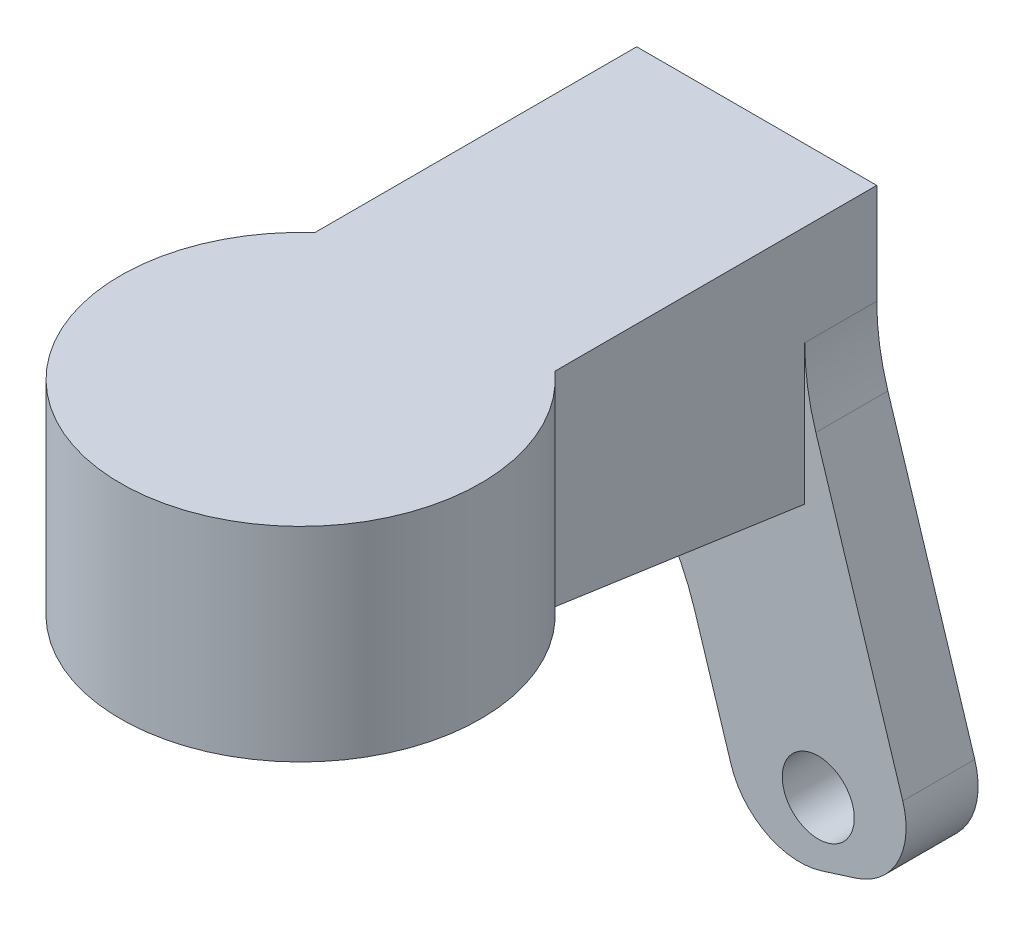
ISO-10303-21;
HEADER;
FILE_DESCRIPTION(('STEP AP214'),'2;1');
FILE_NAME('part.step','',(''),(''),'','','');
FILE_SCHEMA(('AUTOMOTIVE_DESIGN { 1 0 10303 214 1 1 1 1 }'));
ENDSEC;
DATA;
#1=APPLICATION_CONTEXT('core data for automotive mechanical design processes');
#2=APPLICATION_PROTOCOL_DEFINITION('international standard','automotive_design',2000,#1);
#3=PRODUCT_CONTEXT('',#1,'mechanical');
#4=PRODUCT('Part','Part','',(#3));
#5=PRODUCT_RELATED_PRODUCT_CATEGORY('part','',(#4));
#6=PRODUCT_DEFINITION_FORMATION('','',#4);
#7=PRODUCT_DEFINITION_CONTEXT('part definition',#1,'design');
#8=PRODUCT_DEFINITION('design','',#6,#7);
#9=PRODUCT_DEFINITION_SHAPE('','',#8);
#10=(LENGTH_UNIT() NAMED_UNIT(*) SI_UNIT(.MILLI.,.METRE.));
#11=(NAMED_UNIT(*) PLANE_ANGLE_UNIT() SI_UNIT($,.RADIAN.));
#12=(NAMED_UNIT(*) SI_UNIT($,.STERADIAN.) SOLID_ANGLE_UNIT());
#13=UNCERTAINTY_MEASURE_WITH_UNIT(LENGTH_MEASURE(1.E-05),#10,'distance_accuracy_value','');
#14=(GEOMETRIC_REPRESENTATION_CONTEXT(3) GLOBAL_UNCERTAINTY_ASSIGNED_CONTEXT((#13)) GLOBAL_UNIT_ASSIGNED_CONTEXT((#10,
#11,#12)) REPRESENTATION_CONTEXT('',''));
#15=CARTESIAN_POINT('',(0.,0.,0.));
#16=DIRECTION('',(0.,0.,1.));
#17=DIRECTION('',(1.,0.,0.));
#18=AXIS2_PLACEMENT_3D('',#15,#16,#17);
#19=CARTESIAN_POINT('',(0.,8.5,0.));
#20=DIRECTION('',(0.,-1.,0.));
#21=DIRECTION('',(0.,0.,-1.));
#22=AXIS2_PLACEMENT_3D('',#19,#20,#21);
#23=CYLINDRICAL_SURFACE('',#22,7.5);
#24=CARTESIAN_POINT('',(0.,8.5,0.));
#25=DIRECTION('',(0.,1.,0.));
#26=DIRECTION('',(0.,0.,1.));
#27=AXIS2_PLACEMENT_3D('',#24,#25,#26);
#28=CIRCLE('',#27,7.5);
#29=CARTESIAN_POINT('',(-5.,8.5,-5.59016994374948));
#30=VERTEX_POINT('',#29);
#31=CARTESIAN_POINT('',(5.,8.5,-5.59016994374947));
#32=VERTEX_POINT('',#31);
#33=EDGE_CURVE('E201',#30,#32,#28,.T.);
#34=ORIENTED_EDGE('',*,*,#33,.F.);
#35=DIRECTION('',(0.,1.,0.));
#36=VECTOR('',#35,1.);
#37=CARTESIAN_POINT('',(-5.,0.,-5.59016994374948));
#38=LINE('',#37,#36);
#39=CARTESIAN_POINT('',(-5.,0.,-5.59016994374948));
#40=VERTEX_POINT('',#39);
#41=EDGE_CURVE('E187',#40,#30,#38,.T.);
#42=ORIENTED_EDGE('',*,*,#41,.F.);
#43=CARTESIAN_POINT('',(0.,0.,0.));
#44=DIRECTION('',(0.,1.,0.));
#45=DIRECTION('',(0.,0.,1.));
#46=AXIS2_PLACEMENT_3D('',#43,#44,#45);
#47=CIRCLE('',#46,7.5);
#48=CARTESIAN_POINT('',(5.,0.,-5.59016994374947));
#49=VERTEX_POINT('',#48);
#50=EDGE_CURVE('E198',#40,#49,#47,.T.);
#51=ORIENTED_EDGE('',*,*,#50,.T.);
#52=DIRECTION('',(0.,1.,0.));
#53=VECTOR('',#52,1.);
#54=CARTESIAN_POINT('',(5.,0.,-5.59016994374948));
#55=LINE('',#54,#53);
#56=EDGE_CURVE('E192',#49,#32,#55,.T.);
#57=ORIENTED_EDGE('',*,*,#56,.T.);
#58=EDGE_LOOP('',(#34,#42,#51,#57));
#59=FACE_BOUND('',#58,.T.);
#60=ADVANCED_FACE('F33',(#59),#23,.T.);
#61=CARTESIAN_POINT('',(0.,8.5,0.));
#62=DIRECTION('',(0.,1.,0.));
#63=DIRECTION('',(0.,0.,1.));
#64=AXIS2_PLACEMENT_3D('',#61,#62,#63);
#65=PLANE('',#64);
#66=ORIENTED_EDGE('',*,*,#33,.T.);
#67=DIRECTION('',(0.,0.,-1.));
#68=VECTOR('',#67,1.);
#69=CARTESIAN_POINT('',(5.,8.5,-19.));
#70=LINE('',#69,#68);
#71=CARTESIAN_POINT('',(5.,8.5,-19.));
#72=VERTEX_POINT('',#71);
#73=EDGE_CURVE('E181',#32,#72,#70,.T.);
#74=ORIENTED_EDGE('',*,*,#73,.T.);
#75=DIRECTION('',(-1.,0.,0.));
#76=VECTOR('',#75,1.);
#77=CARTESIAN_POINT('',(5.,8.5,-19.));
#78=LINE('',#77,#76);
#79=CARTESIAN_POINT('',(-5.,8.5,-19.));
#80=VERTEX_POINT('',#79);
#81=EDGE_CURVE('E184',#72,#80,#78,.T.);
#82=ORIENTED_EDGE('',*,*,#81,.T.);
#83=DIRECTION('',(0.,0.,1.));
#84=VECTOR('',#83,1.);
#85=CARTESIAN_POINT('',(-5.,8.5,-19.));
#86=LINE('',#85,#84);
#87=EDGE_CURVE('E172',#80,#30,#86,.T.);
#88=ORIENTED_EDGE('',*,*,#87,.T.);
#89=EDGE_LOOP('',(#66,#74,#82,#88));
#90=FACE_BOUND('',#89,.T.);
#91=ADVANCED_FACE('F270',(#90),#65,.T.);
#92=CARTESIAN_POINT('',(0.,0.,0.));
#93=DIRECTION('',(0.,1.,0.));
#94=DIRECTION('',(0.,0.,1.));
#95=AXIS2_PLACEMENT_3D('',#92,#93,#94);
#96=PLANE('',#95);
#97=ORIENTED_EDGE('',*,*,#50,.F.);
#98=DIRECTION('',(1.,0.,0.));
#99=VECTOR('',#98,1.);
#100=CARTESIAN_POINT('',(-5.,0.,-5.59016994374947));
#101=LINE('',#100,#99);
#102=CARTESIAN_POINT('',(-1.34629120178363,0.,-5.59016994374947));
#103=VERTEX_POINT('',#102);
#104=EDGE_CURVE('E151',#40,#103,#101,.T.);
#105=ORIENTED_EDGE('',*,*,#104,.T.);
#106=CARTESIAN_POINT('',(0.,0.,0.));
#107=DIRECTION('',(0.,-1.,0.));
#108=DIRECTION('',(0.,0.,-1.));
#109=AXIS2_PLACEMENT_3D('',#106,#107,#108);
#110=CIRCLE('',#109,5.75);
#111=CARTESIAN_POINT('',(1.34629120178362,0.,-5.59016994374947));
#112=VERTEX_POINT('',#111);
#113=EDGE_CURVE('E189',#112,#103,#110,.T.);
#114=ORIENTED_EDGE('',*,*,#113,.F.);
#115=EDGE_CURVE('E146',#112,#49,#101,.T.);
#116=ORIENTED_EDGE('',*,*,#115,.T.);
#117=EDGE_LOOP('',(#97,#105,#114,#116));
#118=FACE_BOUND('',#117,.T.);
#119=ADVANCED_FACE('F282',(#118),#96,.F.);
#120=CARTESIAN_POINT('',(0.,4.5,0.));
#121=DIRECTION('',(0.,-1.,0.));
#122=DIRECTION('',(0.,0.,-1.));
#123=AXIS2_PLACEMENT_3D('',#120,#121,#122);
#124=CYLINDRICAL_SURFACE('',#123,5.75);
#125=CARTESIAN_POINT('',(0.,4.5,0.));
#126=DIRECTION('',(0.,-1.,0.));
#127=DIRECTION('',(0.,0.,-1.));
#128=AXIS2_PLACEMENT_3D('',#125,#126,#127);
#129=CIRCLE('',#128,5.75);
#130=CARTESIAN_POINT('',(0.,4.5,-5.75));
#131=VERTEX_POINT('',#130);
#132=EDGE_CURVE('E195',#131,#131,#129,.T.);
#133=ORIENTED_EDGE('',*,*,#132,.F.);
#134=EDGE_LOOP('',(#133));
#135=FACE_BOUND('',#134,.T.);
#136=ORIENTED_EDGE('',*,*,#113,.T.);
#137=CARTESIAN_POINT('',(0.,0.,0.));
#138=DIRECTION('',(0.,1.,0.));
#139=DIRECTION('',(0.,0.,1.));
#140=AXIS2_PLACEMENT_3D('',#137,#138,#139);
#141=CIRCLE('',#140,5.75);
#142=EDGE_CURVE('E157',#103,#112,#141,.F.);
#143=ORIENTED_EDGE('',*,*,#142,.T.);
#144=EDGE_LOOP('',(#136,#143));
#145=FACE_BOUND('',#144,.T.);
#146=ADVANCED_FACE('F281',(#135,#145),#124,.F.);
#147=CARTESIAN_POINT('',(0.,4.5,0.));
#148=DIRECTION('',(0.,-1.,0.));
#149=DIRECTION('',(0.,0.,-1.));
#150=AXIS2_PLACEMENT_3D('',#147,#148,#149);
#151=PLANE('',#150);
#152=ORIENTED_EDGE('',*,*,#132,.T.);
#153=EDGE_LOOP('',(#152));
#154=FACE_BOUND('',#153,.T.);
#155=ADVANCED_FACE('F325',(#154),#151,.T.);
#156=CARTESIAN_POINT('',(-5.,0.,-19.));
#157=DIRECTION('',(-1.,0.,0.));
#158=DIRECTION('',(0.,0.,1.));
#159=AXIS2_PLACEMENT_3D('',#156,#157,#158);
#160=PLANE('',#159);
#161=ORIENTED_EDGE('',*,*,#87,.F.);
#162=DIRECTION('',(0.,1.,0.));
#163=VECTOR('',#162,1.);
#164=CARTESIAN_POINT('',(-5.,0.,-19.));
#165=LINE('',#164,#163);
#166=CARTESIAN_POINT('',(-5.,-1.5,-19.));
#167=VERTEX_POINT('',#166);
#168=EDGE_CURVE('E145',#167,#80,#165,.T.);
#169=ORIENTED_EDGE('',*,*,#168,.F.);
#170=DIRECTION('',(0.,0.,-1.));
#171=VECTOR('',#170,1.);
#172=CARTESIAN_POINT('',(-5.,-1.5,-16.));
#173=LINE('',#172,#171);
#174=CARTESIAN_POINT('',(-5.,-1.5,-16.));
#175=VERTEX_POINT('',#174);
#176=EDGE_CURVE('E137',#175,#167,#173,.T.);
#177=ORIENTED_EDGE('',*,*,#176,.F.);
#178=DIRECTION('',(0.,-0.142621535363485,-0.989777296996937));
#179=VECTOR('',#178,1.);
#180=CARTESIAN_POINT('',(-5.,-1.5,-16.));
#181=LINE('',#180,#179);
#182=EDGE_CURVE('E144',#40,#175,#181,.T.);
#183=ORIENTED_EDGE('',*,*,#182,.F.);
#184=ORIENTED_EDGE('',*,*,#41,.T.);
#185=EDGE_LOOP('',(#161,#169,#177,#183,#184));
#186=FACE_BOUND('',#185,.T.);
#187=ADVANCED_FACE('F142',(#186),#160,.T.);
#188=CARTESIAN_POINT('',(5.,0.,-19.));
#189=DIRECTION('',(0.,0.,-1.));
#190=DIRECTION('',(-1.,0.,0.));
#191=AXIS2_PLACEMENT_3D('',#188,#189,#190);
#192=PLANE('',#191);
#193=DIRECTION('',(-0.300705799504267,0.953716950748229,0.));
#194=VECTOR('',#193,1.);
#195=CARTESIAN_POINT('',(-3.527567189288,4.88776233752828,-19.));
#196=LINE('',#195,#194);
#197=CARTESIAN_POINT('',(1.93024307171444,-12.4222003185521,-19.));
#198=VERTEX_POINT('',#197);
#199=CARTESIAN_POINT('',(0.410342102204099,-7.60169030354616,-19.));
#200=VERTEX_POINT('',#199);
#201=EDGE_CURVE('E167',#198,#200,#196,.T.);
#202=ORIENTED_EDGE('',*,*,#201,.T.);
#203=CARTESIAN_POINT('',(-9.12682740527819,-10.6087482985888,-19.));
#204=DIRECTION('',(0.,0.,-1.));
#205=DIRECTION('',(-1.,0.,0.));
#206=AXIS2_PLACEMENT_3D('',#203,#204,#205);
#207=CIRCLE('',#206,10.);
#208=EDGE_CURVE('E11',#200,#167,#207,.F.);
#209=ORIENTED_EDGE('',*,*,#208,.T.);
#210=ORIENTED_EDGE('',*,*,#168,.T.);
#211=ORIENTED_EDGE('',*,*,#81,.F.);
#212=DIRECTION('',(0.,1.,0.));
#213=VECTOR('',#212,1.);
#214=CARTESIAN_POINT('',(5.,0.,-19.));
#215=LINE('',#214,#213);
#216=CARTESIAN_POINT('',(5.,4.32224319945035,-19.));
#217=VERTEX_POINT('',#216);
#218=EDGE_CURVE('E190',#217,#72,#215,.T.);
#219=ORIENTED_EDGE('',*,*,#218,.F.);
#220=CARTESIAN_POINT('',(15.,4.32224319945035,-19.));
#221=DIRECTION('',(0.,0.,-1.));
#222=DIRECTION('',(-1.,0.,0.));
#223=AXIS2_PLACEMENT_3D('',#220,#221,#222);
#224=CIRCLE('',#223,10.);
#225=CARTESIAN_POINT('',(5.46283049251771,1.31518520440768,-19.));
#226=VERTEX_POINT('',#225);
#227=EDGE_CURVE('E233',#217,#226,#224,.F.);
#228=ORIENTED_EDGE('',*,*,#227,.T.);
#229=DIRECTION('',(0.300705799504267,-0.953716950748229,0.));
#230=VECTOR('',#229,1.);
#231=CARTESIAN_POINT('',(3.62530994132371,7.14305583381028,-19.));
#232=LINE('',#231,#230);
#233=CARTESIAN_POINT('',(9.08312020232616,-10.1669068222701,-19.));
#234=VERTEX_POINT('',#233);
#235=EDGE_CURVE('E173',#226,#234,#232,.T.);
#236=ORIENTED_EDGE('',*,*,#235,.T.);
#237=CARTESIAN_POINT('',(6.22196935008147,-11.0690242207829,-19.));
#238=DIRECTION('',(0.,0.,-1.));
#239=DIRECTION('',(-1.,0.,0.));
#240=AXIS2_PLACEMENT_3D('',#237,#238,#239);
#241=CIRCLE('',#240,3.);
#242=CARTESIAN_POINT('',(7.12408674859427,-13.9301750730276,-19.));
#243=VERTEX_POINT('',#242);
#244=EDGE_CURVE('E214',#234,#243,#241,.T.);
#245=ORIENTED_EDGE('',*,*,#244,.T.);
#246=DIRECTION('',(-0.953716950748229,-0.300705799504267,0.));
#247=VECTOR('',#246,1.);
#248=CARTESIAN_POINT('',(9.98523760083896,-13.0280576745148,-19.));
#249=LINE('',#248,#247);
#250=CARTESIAN_POINT('',(5.69351132247193,-14.381233772284,-19.));
#251=VERTEX_POINT('',#250);
#252=EDGE_CURVE('E175',#243,#251,#249,.T.);
#253=ORIENTED_EDGE('',*,*,#252,.T.);
#254=CARTESIAN_POINT('',(4.79139392395913,-11.5200829200393,-19.));
#255=DIRECTION('',(0.,0.,-1.));
#256=DIRECTION('',(-1.,0.,0.));
#257=AXIS2_PLACEMENT_3D('',#254,#255,#256);
#258=CIRCLE('',#257,3.);
#259=EDGE_CURVE('E216',#251,#198,#258,.T.);
#260=ORIENTED_EDGE('',*,*,#259,.T.);
#261=EDGE_LOOP('',(#202,#209,#210,#211,#219,#228,#236,#245,#253,#260));
#262=FACE_BOUND('',#261,.T.);
#263=CARTESIAN_POINT('',(5.56323634885337,-11.8009865008351,-19.));
#264=DIRECTION('',(0.,0.,-1.));
#265=DIRECTION('',(-1.,0.,0.));
#266=AXIS2_PLACEMENT_3D('',#263,#264,#265);
#267=CIRCLE('',#266,1.5);
#268=CARTESIAN_POINT('',(4.06323634885337,-11.8009865008351,-19.));
#269=VERTEX_POINT('',#268);
#270=EDGE_CURVE('E160',#269,#269,#267,.T.);
#271=ORIENTED_EDGE('',*,*,#270,.F.);
#272=EDGE_LOOP('',(#271));
#273=FACE_BOUND('',#272,.T.);
#274=ADVANCED_FACE('F239',(#262,#273),#192,.T.);
#275=CARTESIAN_POINT('',(5.,0.,-19.));
#276=DIRECTION('',(1.,0.,0.));
#277=DIRECTION('',(0.,0.,-1.));
#278=AXIS2_PLACEMENT_3D('',#275,#276,#277);
#279=PLANE('',#278);
#280=DIRECTION('',(0.,1.,0.));
#281=VECTOR('',#280,1.);
#282=CARTESIAN_POINT('',(5.,0.,-16.));
#283=LINE('',#282,#281);
#284=CARTESIAN_POINT('',(5.,-1.5,-16.));
#285=VERTEX_POINT('',#284);
#286=CARTESIAN_POINT('',(5.,4.32224319945035,-16.));
#287=VERTEX_POINT('',#286);
#288=EDGE_CURVE('E125',#285,#287,#283,.T.);
#289=ORIENTED_EDGE('',*,*,#288,.T.);
#290=DIRECTION('',(0.,0.,1.));
#291=VECTOR('',#290,1.);
#292=CARTESIAN_POINT('',(5.,4.32224319945035,-19.));
#293=LINE('',#292,#291);
#294=EDGE_CURVE('E229',#287,#217,#293,.F.);
#295=ORIENTED_EDGE('',*,*,#294,.T.);
#296=ORIENTED_EDGE('',*,*,#218,.T.);
#297=ORIENTED_EDGE('',*,*,#73,.F.);
#298=ORIENTED_EDGE('',*,*,#56,.F.);
#299=DIRECTION('',(0.,-0.142621535363485,-0.989777296996937));
#300=VECTOR('',#299,1.);
#301=CARTESIAN_POINT('',(5.,-1.5,-16.));
#302=LINE('',#301,#300);
#303=EDGE_CURVE('E152',#49,#285,#302,.T.);
#304=ORIENTED_EDGE('',*,*,#303,.T.);
#305=EDGE_LOOP('',(#289,#295,#296,#297,#298,#304));
#306=FACE_BOUND('',#305,.T.);
#307=ADVANCED_FACE('F266',(#306),#279,.T.);
#308=CARTESIAN_POINT('',(-3.527567189288,4.88776233752828,-16.));
#309=DIRECTION('',(-0.953716950748229,-0.300705799504267,0.));
#310=DIRECTION('',(0.300705799504267,-0.953716950748229,0.));
#311=AXIS2_PLACEMENT_3D('',#308,#309,#310);
#312=PLANE('',#311);
#313=DIRECTION('',(-0.300705799504267,0.953716950748229,0.));
#314=VECTOR('',#313,1.);
#315=CARTESIAN_POINT('',(-3.527567189288,4.88776233752828,-16.));
#316=LINE('',#315,#314);
#317=CARTESIAN_POINT('',(1.93024307171444,-12.4222003185521,-16.));
#318=VERTEX_POINT('',#317);
#319=CARTESIAN_POINT('',(0.410342102204099,-7.60169030354616,-16.));
#320=VERTEX_POINT('',#319);
#321=EDGE_CURVE('E170',#318,#320,#316,.T.);
#322=ORIENTED_EDGE('',*,*,#321,.T.);
#323=DIRECTION('',(0.,0.,1.));
#324=VECTOR('',#323,1.);
#325=CARTESIAN_POINT('',(0.410342102204099,-7.60169030354616,-19.));
#326=LINE('',#325,#324);
#327=EDGE_CURVE('E138',#320,#200,#326,.F.);
#328=ORIENTED_EDGE('',*,*,#327,.T.);
#329=ORIENTED_EDGE('',*,*,#201,.F.);
#330=DIRECTION('',(0.,0.,-1.));
#331=VECTOR('',#330,1.);
#332=CARTESIAN_POINT('',(1.93024307171444,-12.4222003185521,-16.));
#333=LINE('',#332,#331);
#334=EDGE_CURVE('E218',#198,#318,#333,.F.);
#335=ORIENTED_EDGE('',*,*,#334,.T.);
#336=EDGE_LOOP('',(#322,#328,#329,#335));
#337=FACE_BOUND('',#336,.T.);
#338=ADVANCED_FACE('F237',(#337),#312,.T.);
#339=CARTESIAN_POINT('',(0.,0.,-16.));
#340=DIRECTION('',(0.,0.,-1.));
#341=DIRECTION('',(-1.,0.,0.));
#342=AXIS2_PLACEMENT_3D('',#339,#340,#341);
#343=PLANE('',#342);
#344=CARTESIAN_POINT('',(5.56323634885337,-11.8009865008351,-16.));
#345=DIRECTION('',(0.,0.,-1.));
#346=DIRECTION('',(-1.,0.,0.));
#347=AXIS2_PLACEMENT_3D('',#344,#345,#346);
#348=CIRCLE('',#347,1.5);
#349=CARTESIAN_POINT('',(4.06323634885337,-11.8009865008351,-16.));
#350=VERTEX_POINT('',#349);
#351=EDGE_CURVE('E163',#350,#350,#348,.T.);
#352=ORIENTED_EDGE('',*,*,#351,.T.);
#353=EDGE_LOOP('',(#352));
#354=FACE_BOUND('',#353,.T.);
#355=ORIENTED_EDGE('',*,*,#288,.F.);
#356=DIRECTION('',(-1.,0.,0.));
#357=VECTOR('',#356,1.);
#358=CARTESIAN_POINT('',(0.,-1.5,-16.));
#359=LINE('',#358,#357);
#360=EDGE_CURVE('E122',#285,#175,#359,.T.);
#361=ORIENTED_EDGE('',*,*,#360,.T.);
#362=CARTESIAN_POINT('',(-9.12682740527819,-10.6087482985888,-16.));
#363=DIRECTION('',(0.,0.,-1.));
#364=DIRECTION('',(-1.,0.,0.));
#365=AXIS2_PLACEMENT_3D('',#362,#363,#364);
#366=CIRCLE('',#365,10.);
#367=EDGE_CURVE('E42',#175,#320,#366,.T.);
#368=ORIENTED_EDGE('',*,*,#367,.T.);
#369=ORIENTED_EDGE('',*,*,#321,.F.);
#370=CARTESIAN_POINT('',(4.79139392395913,-11.5200829200393,-16.));
#371=DIRECTION('',(0.,0.,-1.));
#372=DIRECTION('',(-1.,0.,0.));
#373=AXIS2_PLACEMENT_3D('',#370,#371,#372);
#374=CIRCLE('',#373,3.);
#375=CARTESIAN_POINT('',(5.69351132247193,-14.381233772284,-16.));
#376=VERTEX_POINT('',#375);
#377=EDGE_CURVE('E223',#318,#376,#374,.F.);
#378=ORIENTED_EDGE('',*,*,#377,.T.);
#379=DIRECTION('',(-0.953716950748229,-0.300705799504267,0.));
#380=VECTOR('',#379,1.);
#381=CARTESIAN_POINT('',(9.98523760083896,-13.0280576745148,-16.));
#382=LINE('',#381,#380);
#383=CARTESIAN_POINT('',(7.12408674859427,-13.9301750730276,-16.));
#384=VERTEX_POINT('',#383);
#385=EDGE_CURVE('E166',#384,#376,#382,.T.);
#386=ORIENTED_EDGE('',*,*,#385,.F.);
#387=CARTESIAN_POINT('',(6.22196935008147,-11.0690242207829,-16.));
#388=DIRECTION('',(0.,0.,-1.));
#389=DIRECTION('',(-1.,0.,0.));
#390=AXIS2_PLACEMENT_3D('',#387,#388,#389);
#391=CIRCLE('',#390,3.);
#392=CARTESIAN_POINT('',(9.08312020232616,-10.1669068222701,-16.));
#393=VERTEX_POINT('',#392);
#394=EDGE_CURVE('E220',#384,#393,#391,.F.);
#395=ORIENTED_EDGE('',*,*,#394,.T.);
#396=DIRECTION('',(0.300705799504267,-0.953716950748229,0.));
#397=VECTOR('',#396,1.);
#398=CARTESIAN_POINT('',(3.62530994132371,7.14305583381028,-16.));
#399=LINE('',#398,#397);
#400=CARTESIAN_POINT('',(5.46283049251771,1.31518520440768,-16.));
#401=VERTEX_POINT('',#400);
#402=EDGE_CURVE('E164',#401,#393,#399,.T.);
#403=ORIENTED_EDGE('',*,*,#402,.F.);
#404=CARTESIAN_POINT('',(15.,4.32224319945035,-16.));
#405=DIRECTION('',(0.,0.,-1.));
#406=DIRECTION('',(-1.,0.,0.));
#407=AXIS2_PLACEMENT_3D('',#404,#405,#406);
#408=CIRCLE('',#407,10.);
#409=EDGE_CURVE('E231',#401,#287,#408,.T.);
#410=ORIENTED_EDGE('',*,*,#409,.T.);
#411=EDGE_LOOP('',(#355,#361,#368,#369,#378,#386,#395,#403,#410));
#412=FACE_BOUND('',#411,.T.);
#413=ADVANCED_FACE('F123',(#354,#412),#343,.F.);
#414=CARTESIAN_POINT('',(9.98523760083896,-13.0280576745148,-16.));
#415=DIRECTION('',(0.300705799504267,-0.953716950748229,0.));
#416=DIRECTION('',(0.953716950748229,0.300705799504267,0.));
#417=AXIS2_PLACEMENT_3D('',#414,#415,#416);
#418=PLANE('',#417);
#419=ORIENTED_EDGE('',*,*,#385,.T.);
#420=DIRECTION('',(0.,0.,-1.));
#421=VECTOR('',#420,1.);
#422=CARTESIAN_POINT('',(5.69351132247193,-14.381233772284,-16.));
#423=LINE('',#422,#421);
#424=EDGE_CURVE('E211',#376,#251,#423,.T.);
#425=ORIENTED_EDGE('',*,*,#424,.T.);
#426=ORIENTED_EDGE('',*,*,#252,.F.);
#427=DIRECTION('',(0.,0.,-1.));
#428=VECTOR('',#427,1.);
#429=CARTESIAN_POINT('',(7.12408674859427,-13.9301750730276,-16.));
#430=LINE('',#429,#428);
#431=EDGE_CURVE('E207',#243,#384,#430,.F.);
#432=ORIENTED_EDGE('',*,*,#431,.T.);
#433=EDGE_LOOP('',(#419,#425,#426,#432));
#434=FACE_BOUND('',#433,.T.);
#435=ADVANCED_FACE('F247',(#434),#418,.T.);
#436=CARTESIAN_POINT('',(3.62530994132371,7.14305583381028,-16.));
#437=DIRECTION('',(0.953716950748229,0.300705799504267,0.));
#438=DIRECTION('',(-0.300705799504267,0.953716950748229,0.));
#439=AXIS2_PLACEMENT_3D('',#436,#437,#438);
#440=PLANE('',#439);
#441=ORIENTED_EDGE('',*,*,#235,.F.);
#442=DIRECTION('',(0.,0.,1.));
#443=VECTOR('',#442,1.);
#444=CARTESIAN_POINT('',(5.46283049251771,1.31518520440768,-16.));
#445=LINE('',#444,#443);
#446=EDGE_CURVE('E130',#226,#401,#445,.T.);
#447=ORIENTED_EDGE('',*,*,#446,.T.);
#448=ORIENTED_EDGE('',*,*,#402,.T.);
#449=DIRECTION('',(0.,0.,-1.));
#450=VECTOR('',#449,1.);
#451=CARTESIAN_POINT('',(9.08312020232616,-10.1669068222701,-16.));
#452=LINE('',#451,#450);
#453=EDGE_CURVE('E131',#393,#234,#452,.T.);
#454=ORIENTED_EDGE('',*,*,#453,.T.);
#455=EDGE_LOOP('',(#441,#447,#448,#454));
#456=FACE_BOUND('',#455,.T.);
#457=ADVANCED_FACE('F258',(#456),#440,.T.);
#458=CARTESIAN_POINT('',(5.56323634885337,-11.8009865008351,7.5));
#459=DIRECTION('',(0.,0.,-1.));
#460=DIRECTION('',(-1.,0.,0.));
#461=AXIS2_PLACEMENT_3D('',#458,#459,#460);
#462=CYLINDRICAL_SURFACE('',#461,1.5);
#463=ORIENTED_EDGE('',*,*,#270,.T.);
#464=EDGE_LOOP('',(#463));
#465=FACE_BOUND('',#464,.T.);
#466=ORIENTED_EDGE('',*,*,#351,.F.);
#467=EDGE_LOOP('',(#466));
#468=FACE_BOUND('',#467,.T.);
#469=ADVANCED_FACE('F294',(#465,#468),#462,.F.);
#470=CARTESIAN_POINT('',(4.79139392395913,-11.5200829200393,-16.));
#471=DIRECTION('',(0.,0.,-1.));
#472=DIRECTION('',(-1.,0.,0.));
#473=AXIS2_PLACEMENT_3D('',#470,#471,#472);
#474=CYLINDRICAL_SURFACE('',#473,3.);
#475=ORIENTED_EDGE('',*,*,#377,.F.);
#476=ORIENTED_EDGE('',*,*,#334,.F.);
#477=ORIENTED_EDGE('',*,*,#259,.F.);
#478=ORIENTED_EDGE('',*,*,#424,.F.);
#479=EDGE_LOOP('',(#475,#476,#477,#478));
#480=FACE_BOUND('',#479,.T.);
#481=ADVANCED_FACE('F245',(#480),#474,.T.);
#482=CARTESIAN_POINT('',(6.22196935008147,-11.0690242207829,-16.));
#483=DIRECTION('',(0.,0.,-1.));
#484=DIRECTION('',(-1.,0.,0.));
#485=AXIS2_PLACEMENT_3D('',#482,#483,#484);
#486=CYLINDRICAL_SURFACE('',#485,3.);
#487=ORIENTED_EDGE('',*,*,#394,.F.);
#488=ORIENTED_EDGE('',*,*,#431,.F.);
#489=ORIENTED_EDGE('',*,*,#244,.F.);
#490=ORIENTED_EDGE('',*,*,#453,.F.);
#491=EDGE_LOOP('',(#487,#488,#489,#490));
#492=FACE_BOUND('',#491,.T.);
#493=ADVANCED_FACE('F254',(#492),#486,.T.);
#494=CARTESIAN_POINT('',(-5.,0.,-5.59016994374947));
#495=DIRECTION('',(0.,1.,0.));
#496=DIRECTION('',(0.,0.,1.));
#497=AXIS2_PLACEMENT_3D('',#494,#495,#496);
#498=PLANE('',#497);
#499=ORIENTED_EDGE('',*,*,#142,.F.);
#500=EDGE_CURVE('E158',#103,#112,#101,.T.);
#501=ORIENTED_EDGE('',*,*,#500,.T.);
#502=EDGE_LOOP('',(#499,#501));
#503=FACE_BOUND('',#502,.T.);
#504=ADVANCED_FACE('F279',(#503),#498,.T.);
#505=CARTESIAN_POINT('',(-5.,-1.5,-16.));
#506=DIRECTION('',(0.,-0.989777296996937,0.142621535363485));
#507=DIRECTION('',(0.,-0.142621535363485,-0.989777296996937));
#508=AXIS2_PLACEMENT_3D('',#505,#506,#507);
#509=PLANE('',#508);
#510=ORIENTED_EDGE('',*,*,#303,.F.);
#511=ORIENTED_EDGE('',*,*,#115,.F.);
#512=ORIENTED_EDGE('',*,*,#500,.F.);
#513=ORIENTED_EDGE('',*,*,#104,.F.);
#514=ORIENTED_EDGE('',*,*,#182,.T.);
#515=ORIENTED_EDGE('',*,*,#360,.F.);
#516=EDGE_LOOP('',(#510,#511,#512,#513,#514,#515));
#517=FACE_BOUND('',#516,.T.);
#518=ADVANCED_FACE('F149',(#517),#509,.T.);
#519=CARTESIAN_POINT('',(15.,4.32224319945035,-16.));
#520=DIRECTION('',(0.,0.,-1.));
#521=DIRECTION('',(0.,1.,0.));
#522=AXIS2_PLACEMENT_3D('',#519,#520,#521);
#523=CYLINDRICAL_SURFACE('',#522,10.);
#524=ORIENTED_EDGE('',*,*,#227,.F.);
#525=ORIENTED_EDGE('',*,*,#294,.F.);
#526=ORIENTED_EDGE('',*,*,#409,.F.);
#527=ORIENTED_EDGE('',*,*,#446,.F.);
#528=EDGE_LOOP('',(#524,#525,#526,#527));
#529=FACE_BOUND('',#528,.T.);
#530=ADVANCED_FACE('F263',(#529),#523,.F.);
#531=CARTESIAN_POINT('',(-9.12682740527819,-10.6087482985888,-16.));
#532=DIRECTION('',(0.,0.,-1.));
#533=DIRECTION('',(-1.,0.,0.));
#534=AXIS2_PLACEMENT_3D('',#531,#532,#533);
#535=CYLINDRICAL_SURFACE('',#534,10.);
#536=ORIENTED_EDGE('',*,*,#208,.F.);
#537=ORIENTED_EDGE('',*,*,#327,.F.);
#538=ORIENTED_EDGE('',*,*,#367,.F.);
#539=ORIENTED_EDGE('',*,*,#176,.T.);
#540=EDGE_LOOP('',(#536,#537,#538,#539));
#541=FACE_BOUND('',#540,.T.);
#542=ADVANCED_FACE('F35',(#541),#535,.F.);
#543=CLOSED_SHELL('',(#60,#91,#119,#146,#155,#187,#274,#307,#338,#413,#435,#457,#469,#481,#493,
#504,#518,#530,#542));
#544=MANIFOLD_SOLID_BREP('B2',#543);
#545=ADVANCED_BREP_SHAPE_REPRESENTATION('',(#18,#544),#14);
#546=SHAPE_DEFINITION_REPRESENTATION(#9,#545);
ENDSEC;
END-ISO-10303-21;
